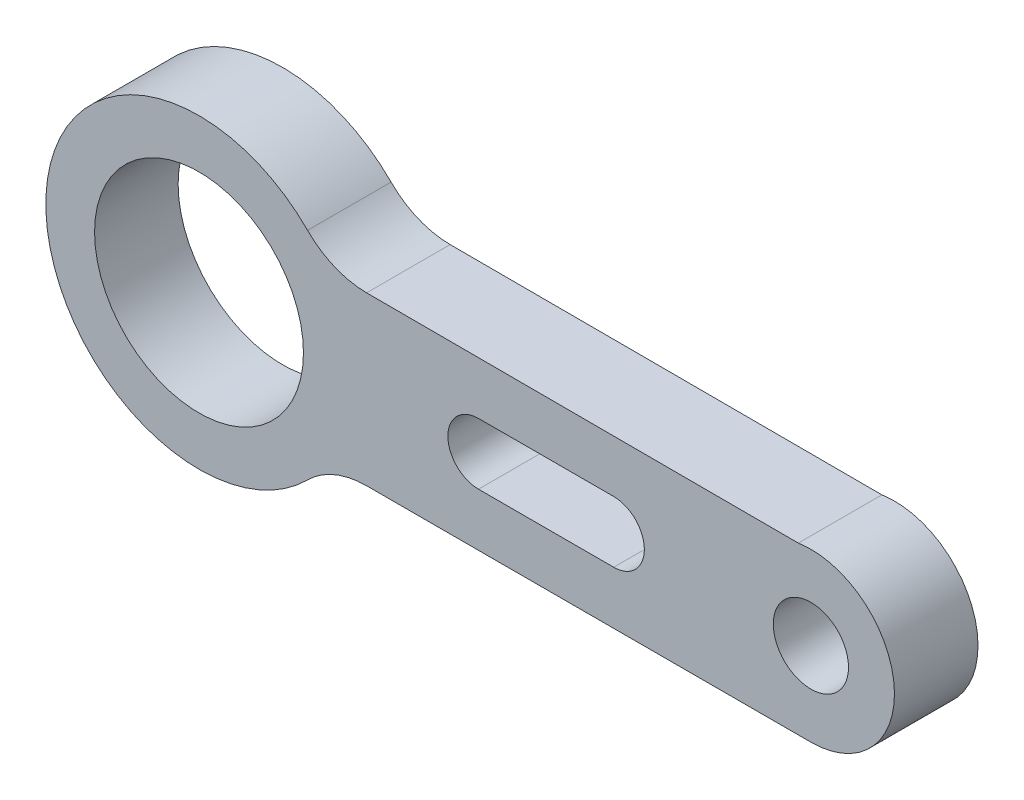
ISO-10303-21;
HEADER;
FILE_DESCRIPTION(('STEP AP214'),'2;1');
FILE_NAME('part.step','',(''),(''),'','','');
FILE_SCHEMA(('AUTOMOTIVE_DESIGN { 1 0 10303 214 1 1 1 1 }'));
ENDSEC;
DATA;
#1=APPLICATION_CONTEXT('core data for automotive mechanical design processes');
#2=APPLICATION_PROTOCOL_DEFINITION('international standard','automotive_design',2000,#1);
#3=PRODUCT_CONTEXT('',#1,'mechanical');
#4=PRODUCT('Part','Part','',(#3));
#5=PRODUCT_RELATED_PRODUCT_CATEGORY('part','',(#4));
#6=PRODUCT_DEFINITION_FORMATION('','',#4);
#7=PRODUCT_DEFINITION_CONTEXT('part definition',#1,'design');
#8=PRODUCT_DEFINITION('design','',#6,#7);
#9=PRODUCT_DEFINITION_SHAPE('','',#8);
#10=(LENGTH_UNIT() NAMED_UNIT(*) SI_UNIT(.MILLI.,.METRE.));
#11=(NAMED_UNIT(*) PLANE_ANGLE_UNIT() SI_UNIT($,.RADIAN.));
#12=(NAMED_UNIT(*) SI_UNIT($,.STERADIAN.) SOLID_ANGLE_UNIT());
#13=UNCERTAINTY_MEASURE_WITH_UNIT(LENGTH_MEASURE(1.E-05),#10,'distance_accuracy_value','');
#14=(GEOMETRIC_REPRESENTATION_CONTEXT(3) GLOBAL_UNCERTAINTY_ASSIGNED_CONTEXT((#13)) GLOBAL_UNIT_ASSIGNED_CONTEXT((#10,
#11,#12)) REPRESENTATION_CONTEXT('',''));
#15=CARTESIAN_POINT('',(0.,0.,0.));
#16=DIRECTION('',(0.,0.,1.));
#17=DIRECTION('',(1.,0.,0.));
#18=AXIS2_PLACEMENT_3D('',#15,#16,#17);
#19=CARTESIAN_POINT('',(-3.98797726940064,21.4662374553055,3.));
#20=DIRECTION('',(0.,0.,1.));
#21=DIRECTION('',(1.,0.,0.));
#22=AXIS2_PLACEMENT_3D('',#19,#20,#21);
#23=PLANE('',#22);
#24=CARTESIAN_POINT('',(-25.9582811689159,21.4662374553055,3.));
#25=DIRECTION('',(0.,0.,1.));
#26=DIRECTION('',(1.,0.,0.));
#27=AXIS2_PLACEMENT_3D('',#24,#25,#26);
#28=CIRCLE('',#27,3.75);
#29=CARTESIAN_POINT('',(-22.2082811689159,21.4662374553055,3.));
#30=VERTEX_POINT('',#29);
#31=EDGE_CURVE('E152',#30,#30,#28,.T.);
#32=ORIENTED_EDGE('',*,*,#31,.F.);
#33=EDGE_LOOP('',(#32));
#34=FACE_BOUND('',#33,.T.);
#35=CARTESIAN_POINT('',(-3.98797726940064,21.4662374553055,3.));
#36=DIRECTION('',(0.,0.,1.));
#37=DIRECTION('',(1.,0.,0.));
#38=AXIS2_PLACEMENT_3D('',#35,#36,#37);
#39=CIRCLE('',#38,3.);
#40=CARTESIAN_POINT('',(-3.98797726940064,18.4662374553055,3.));
#41=VERTEX_POINT('',#40);
#42=CARTESIAN_POINT('',(-4.43963692197603,24.432043173527,3.));
#43=VERTEX_POINT('',#42);
#44=EDGE_CURVE('E164',#41,#43,#39,.T.);
#45=ORIENTED_EDGE('',*,*,#44,.T.);
#46=DIRECTION('',(-0.999997970749834,0.00201457097501609,0.));
#47=VECTOR('',#46,1.);
#48=CARTESIAN_POINT('',(-4.43963692197603,24.432043173527,3.));
#49=LINE('',#48,#47);
#50=CARTESIAN_POINT('',(-19.940566739442,24.4632709601921,3.));
#51=VERTEX_POINT('',#50);
#52=EDGE_CURVE('E167',#43,#51,#49,.T.);
#53=ORIENTED_EDGE('',*,*,#52,.T.);
#54=CARTESIAN_POINT('',(-19.9345230265169,27.4632648724416,3.));
#55=DIRECTION('',(0.,0.,-1.));
#56=DIRECTION('',(-1.,0.,0.));
#57=AXIS2_PLACEMENT_3D('',#54,#55,#56);
#58=CIRCLE('',#57,3.);
#59=CARTESIAN_POINT('',(-22.0605553120695,25.3466669605112,3.));
#60=VERTEX_POINT('',#59);
#61=EDGE_CURVE('E170',#51,#60,#58,.T.);
#62=ORIENTED_EDGE('',*,*,#61,.T.);
#63=CARTESIAN_POINT('',(-25.9582811689159,21.4662374553055,3.));
#64=DIRECTION('',(0.,0.,1.));
#65=DIRECTION('',(1.,0.,0.));
#66=AXIS2_PLACEMENT_3D('',#63,#64,#65);
#67=CIRCLE('',#66,5.5);
#68=CARTESIAN_POINT('',(-22.0643681839501,17.5819818425125,3.));
#69=VERTEX_POINT('',#68);
#70=EDGE_CURVE('E172',#60,#69,#67,.T.);
#71=ORIENTED_EDGE('',*,*,#70,.T.);
#72=CARTESIAN_POINT('',(-19.940415646696,15.4632969628072,3.));
#73=DIRECTION('',(0.,0.,-1.));
#74=DIRECTION('',(1.,0.,0.));
#75=AXIS2_PLACEMENT_3D('',#72,#73,#74);
#76=CIRCLE('',#75,3.);
#77=CARTESIAN_POINT('',(-19.9409686232532,18.4632969118433,3.));
#78=VERTEX_POINT('',#77);
#79=EDGE_CURVE('E174',#69,#78,#76,.T.);
#80=ORIENTED_EDGE('',*,*,#79,.T.);
#81=DIRECTION('',(0.999999983012051,0.000184325519082915,0.));
#82=VECTOR('',#81,1.);
#83=CARTESIAN_POINT('',(-3.98797726940064,18.4662374553055,3.));
#84=LINE('',#83,#82);
#85=EDGE_CURVE('E176',#78,#41,#84,.T.);
#86=ORIENTED_EDGE('',*,*,#85,.T.);
#87=EDGE_LOOP('',(#45,#53,#62,#71,#80,#86));
#88=FACE_BOUND('',#87,.T.);
#89=CARTESIAN_POINT('',(-3.98797726940064,21.4662374553055,3.));
#90=DIRECTION('',(0.,0.,1.));
#91=DIRECTION('',(1.,0.,0.));
#92=AXIS2_PLACEMENT_3D('',#89,#90,#91);
#93=CIRCLE('',#92,1.35);
#94=CARTESIAN_POINT('',(-2.63797726940064,21.4662374553055,3.));
#95=VERTEX_POINT('',#94);
#96=EDGE_CURVE('E158',#95,#95,#93,.T.);
#97=ORIENTED_EDGE('',*,*,#96,.F.);
#98=EDGE_LOOP('',(#97));
#99=FACE_BOUND('',#98,.T.);
#100=DIRECTION('',(1.,0.,0.));
#101=VECTOR('',#100,1.);
#102=CARTESIAN_POINT('',(-15.9219501795346,20.3662374553055,3.));
#103=LINE('',#102,#101);
#104=CARTESIAN_POINT('',(-15.9219501795346,20.3662374553055,3.));
#105=VERTEX_POINT('',#104);
#106=CARTESIAN_POINT('',(-11.0683555835525,20.3662374553055,3.));
#107=VERTEX_POINT('',#106);
#108=EDGE_CURVE('E124',#105,#107,#103,.T.);
#109=ORIENTED_EDGE('',*,*,#108,.F.);
#110=CARTESIAN_POINT('',(-15.9219501795346,21.4662374553055,3.));
#111=DIRECTION('',(0.,0.,1.));
#112=DIRECTION('',(1.,0.,0.));
#113=AXIS2_PLACEMENT_3D('',#110,#111,#112);
#114=CIRCLE('',#113,1.1);
#115=CARTESIAN_POINT('',(-15.9219501795346,22.5662374553055,3.));
#116=VERTEX_POINT('',#115);
#117=EDGE_CURVE('E116',#116,#105,#114,.T.);
#118=ORIENTED_EDGE('',*,*,#117,.F.);
#119=DIRECTION('',(-1.,0.,0.));
#120=VECTOR('',#119,1.);
#121=CARTESIAN_POINT('',(-15.9219501795346,22.5662374553055,3.));
#122=LINE('',#121,#120);
#123=CARTESIAN_POINT('',(-11.0683555835525,22.5662374553055,3.));
#124=VERTEX_POINT('',#123);
#125=EDGE_CURVE('E138',#124,#116,#122,.T.);
#126=ORIENTED_EDGE('',*,*,#125,.F.);
#127=CARTESIAN_POINT('',(-11.0683555835525,21.4662374553055,3.));
#128=DIRECTION('',(0.,0.,1.));
#129=DIRECTION('',(1.,0.,0.));
#130=AXIS2_PLACEMENT_3D('',#127,#128,#129);
#131=CIRCLE('',#130,1.1);
#132=EDGE_CURVE('E136',#107,#124,#131,.T.);
#133=ORIENTED_EDGE('',*,*,#132,.F.);
#134=EDGE_LOOP('',(#109,#118,#126,#133));
#135=FACE_BOUND('',#134,.T.);
#136=ADVANCED_FACE('F39',(#34,#88,#99,#135),#23,.T.);
#137=CARTESIAN_POINT('',(-3.98797726940064,21.4662374553055,0.));
#138=DIRECTION('',(0.,0.,1.));
#139=DIRECTION('',(1.,0.,0.));
#140=AXIS2_PLACEMENT_3D('',#137,#138,#139);
#141=PLANE('',#140);
#142=CARTESIAN_POINT('',(-25.9582811689159,21.4662374553055,0.));
#143=DIRECTION('',(0.,0.,1.));
#144=DIRECTION('',(1.,0.,0.));
#145=AXIS2_PLACEMENT_3D('',#142,#143,#144);
#146=CIRCLE('',#145,3.75);
#147=CARTESIAN_POINT('',(-22.2082811689159,21.4662374553055,0.));
#148=VERTEX_POINT('',#147);
#149=EDGE_CURVE('E132',#148,#148,#146,.T.);
#150=ORIENTED_EDGE('',*,*,#149,.T.);
#151=EDGE_LOOP('',(#150));
#152=FACE_BOUND('',#151,.T.);
#153=CARTESIAN_POINT('',(-3.98797726940064,21.4662374553055,0.));
#154=DIRECTION('',(0.,0.,1.));
#155=DIRECTION('',(1.,0.,0.));
#156=AXIS2_PLACEMENT_3D('',#153,#154,#155);
#157=CIRCLE('',#156,3.);
#158=CARTESIAN_POINT('',(-3.98797726940064,18.4662374553055,0.));
#159=VERTEX_POINT('',#158);
#160=CARTESIAN_POINT('',(-4.43963692197603,24.432043173527,0.));
#161=VERTEX_POINT('',#160);
#162=EDGE_CURVE('E161',#159,#161,#157,.T.);
#163=ORIENTED_EDGE('',*,*,#162,.F.);
#164=DIRECTION('',(0.999999983012051,0.000184325519082915,0.));
#165=VECTOR('',#164,1.);
#166=CARTESIAN_POINT('',(-3.98797726940064,18.4662374553055,0.));
#167=LINE('',#166,#165);
#168=CARTESIAN_POINT('',(-19.9409686232532,18.4632969118433,0.));
#169=VERTEX_POINT('',#168);
#170=EDGE_CURVE('E168',#169,#159,#167,.T.);
#171=ORIENTED_EDGE('',*,*,#170,.F.);
#172=CARTESIAN_POINT('',(-19.940415646696,15.4632969628072,0.));
#173=DIRECTION('',(0.,0.,-1.));
#174=DIRECTION('',(1.,0.,0.));
#175=AXIS2_PLACEMENT_3D('',#172,#173,#174);
#176=CIRCLE('',#175,3.);
#177=CARTESIAN_POINT('',(-22.0643681839501,17.5819818425125,0.));
#178=VERTEX_POINT('',#177);
#179=EDGE_CURVE('E187',#178,#169,#176,.T.);
#180=ORIENTED_EDGE('',*,*,#179,.F.);
#181=CARTESIAN_POINT('',(-25.9582811689159,21.4662374553055,0.));
#182=DIRECTION('',(0.,0.,1.));
#183=DIRECTION('',(1.,0.,0.));
#184=AXIS2_PLACEMENT_3D('',#181,#182,#183);
#185=CIRCLE('',#184,5.5);
#186=CARTESIAN_POINT('',(-22.0605553120695,25.3466669605112,0.));
#187=VERTEX_POINT('',#186);
#188=EDGE_CURVE('E185',#187,#178,#185,.T.);
#189=ORIENTED_EDGE('',*,*,#188,.F.);
#190=CARTESIAN_POINT('',(-19.9345230265169,27.4632648724416,0.));
#191=DIRECTION('',(0.,0.,-1.));
#192=DIRECTION('',(-1.,0.,0.));
#193=AXIS2_PLACEMENT_3D('',#190,#191,#192);
#194=CIRCLE('',#193,3.);
#195=CARTESIAN_POINT('',(-19.940566739442,24.4632709601921,0.));
#196=VERTEX_POINT('',#195);
#197=EDGE_CURVE('E183',#196,#187,#194,.T.);
#198=ORIENTED_EDGE('',*,*,#197,.F.);
#199=DIRECTION('',(-0.999997970749834,0.00201457097501609,0.));
#200=VECTOR('',#199,1.);
#201=CARTESIAN_POINT('',(-4.43963692197603,24.432043173527,0.));
#202=LINE('',#201,#200);
#203=EDGE_CURVE('E181',#161,#196,#202,.T.);
#204=ORIENTED_EDGE('',*,*,#203,.F.);
#205=EDGE_LOOP('',(#163,#171,#180,#189,#198,#204));
#206=FACE_BOUND('',#205,.T.);
#207=CARTESIAN_POINT('',(-3.98797726940064,21.4662374553055,0.));
#208=DIRECTION('',(0.,0.,1.));
#209=DIRECTION('',(1.,0.,0.));
#210=AXIS2_PLACEMENT_3D('',#207,#208,#209);
#211=CIRCLE('',#210,1.35);
#212=CARTESIAN_POINT('',(-2.63797726940064,21.4662374553055,0.));
#213=VERTEX_POINT('',#212);
#214=EDGE_CURVE('E155',#213,#213,#211,.T.);
#215=ORIENTED_EDGE('',*,*,#214,.T.);
#216=EDGE_LOOP('',(#215));
#217=FACE_BOUND('',#216,.T.);
#218=CARTESIAN_POINT('',(-15.9219501795346,21.4662374553055,0.));
#219=DIRECTION('',(0.,0.,1.));
#220=DIRECTION('',(1.,0.,0.));
#221=AXIS2_PLACEMENT_3D('',#218,#219,#220);
#222=CIRCLE('',#221,1.1);
#223=CARTESIAN_POINT('',(-15.9219501795346,22.5662374553055,0.));
#224=VERTEX_POINT('',#223);
#225=CARTESIAN_POINT('',(-15.9219501795346,20.3662374553055,0.));
#226=VERTEX_POINT('',#225);
#227=EDGE_CURVE('E62',#224,#226,#222,.T.);
#228=ORIENTED_EDGE('',*,*,#227,.T.);
#229=DIRECTION('',(1.,0.,0.));
#230=VECTOR('',#229,1.);
#231=CARTESIAN_POINT('',(-15.9219501795346,20.3662374553055,0.));
#232=LINE('',#231,#230);
#233=CARTESIAN_POINT('',(-11.0683555835525,20.3662374553055,0.));
#234=VERTEX_POINT('',#233);
#235=EDGE_CURVE('E131',#226,#234,#232,.T.);
#236=ORIENTED_EDGE('',*,*,#235,.T.);
#237=CARTESIAN_POINT('',(-11.0683555835525,21.4662374553055,0.));
#238=DIRECTION('',(0.,0.,1.));
#239=DIRECTION('',(1.,0.,0.));
#240=AXIS2_PLACEMENT_3D('',#237,#238,#239);
#241=CIRCLE('',#240,1.1);
#242=CARTESIAN_POINT('',(-11.0683555835525,22.5662374553055,0.));
#243=VERTEX_POINT('',#242);
#244=EDGE_CURVE('E144',#234,#243,#241,.T.);
#245=ORIENTED_EDGE('',*,*,#244,.T.);
#246=DIRECTION('',(-1.,0.,0.));
#247=VECTOR('',#246,1.);
#248=CARTESIAN_POINT('',(-15.9219501795346,22.5662374553055,0.));
#249=LINE('',#248,#247);
#250=EDGE_CURVE('E125',#243,#224,#249,.T.);
#251=ORIENTED_EDGE('',*,*,#250,.T.);
#252=EDGE_LOOP('',(#228,#236,#245,#251));
#253=FACE_BOUND('',#252,.T.);
#254=ADVANCED_FACE('F211',(#152,#206,#217,#253),#141,.F.);
#255=CARTESIAN_POINT('',(-3.98797726940064,21.4662374553055,3.));
#256=DIRECTION('',(0.,0.,-1.));
#257=DIRECTION('',(-1.,0.,0.));
#258=AXIS2_PLACEMENT_3D('',#255,#256,#257);
#259=CYLINDRICAL_SURFACE('',#258,3.);
#260=ORIENTED_EDGE('',*,*,#162,.T.);
#261=DIRECTION('',(0.,0.,-1.));
#262=VECTOR('',#261,1.);
#263=CARTESIAN_POINT('',(-4.43963692197603,24.432043173527,3.));
#264=LINE('',#263,#262);
#265=EDGE_CURVE('E11',#43,#161,#264,.T.);
#266=ORIENTED_EDGE('',*,*,#265,.F.);
#267=ORIENTED_EDGE('',*,*,#44,.F.);
#268=DIRECTION('',(0.,0.,-1.));
#269=VECTOR('',#268,1.);
#270=CARTESIAN_POINT('',(-3.98797726940064,18.4662374553055,3.));
#271=LINE('',#270,#269);
#272=EDGE_CURVE('E178',#41,#159,#271,.T.);
#273=ORIENTED_EDGE('',*,*,#272,.T.);
#274=EDGE_LOOP('',(#260,#266,#267,#273));
#275=FACE_BOUND('',#274,.T.);
#276=ADVANCED_FACE('F41',(#275),#259,.T.);
#277=CARTESIAN_POINT('',(-4.43963692197603,24.432043173527,3.));
#278=DIRECTION('',(-0.00201457097501609,-0.999997970749834,0.));
#279=DIRECTION('',(0.999997970749835,-0.00201457097501609,0.));
#280=AXIS2_PLACEMENT_3D('',#277,#278,#279);
#281=PLANE('',#280);
#282=ORIENTED_EDGE('',*,*,#203,.T.);
#283=DIRECTION('',(0.,0.,-1.));
#284=VECTOR('',#283,1.);
#285=CARTESIAN_POINT('',(-19.940566739442,24.4632709601921,3.));
#286=LINE('',#285,#284);
#287=EDGE_CURVE('E47',#51,#196,#286,.T.);
#288=ORIENTED_EDGE('',*,*,#287,.F.);
#289=ORIENTED_EDGE('',*,*,#52,.F.);
#290=ORIENTED_EDGE('',*,*,#265,.T.);
#291=EDGE_LOOP('',(#282,#288,#289,#290));
#292=FACE_BOUND('',#291,.T.);
#293=ADVANCED_FACE('F229',(#292),#281,.F.);
#294=CARTESIAN_POINT('',(-19.9345230265169,27.4632648724416,3.));
#295=DIRECTION('',(0.,0.,-1.));
#296=DIRECTION('',(-1.,0.,0.));
#297=AXIS2_PLACEMENT_3D('',#294,#295,#296);
#298=CYLINDRICAL_SURFACE('',#297,3.);
#299=ORIENTED_EDGE('',*,*,#197,.T.);
#300=DIRECTION('',(0.,0.,-1.));
#301=VECTOR('',#300,1.);
#302=CARTESIAN_POINT('',(-22.0605553120695,25.3466669605112,3.));
#303=LINE('',#302,#301);
#304=EDGE_CURVE('E198',#60,#187,#303,.T.);
#305=ORIENTED_EDGE('',*,*,#304,.F.);
#306=ORIENTED_EDGE('',*,*,#61,.F.);
#307=ORIENTED_EDGE('',*,*,#287,.T.);
#308=EDGE_LOOP('',(#299,#305,#306,#307));
#309=FACE_BOUND('',#308,.T.);
#310=ADVANCED_FACE('F205',(#309),#298,.F.);
#311=CARTESIAN_POINT('',(-25.9582811689159,21.4662374553055,3.));
#312=DIRECTION('',(0.,0.,-1.));
#313=DIRECTION('',(-1.,0.,0.));
#314=AXIS2_PLACEMENT_3D('',#311,#312,#313);
#315=CYLINDRICAL_SURFACE('',#314,5.5);
#316=ORIENTED_EDGE('',*,*,#188,.T.);
#317=DIRECTION('',(0.,0.,-1.));
#318=VECTOR('',#317,1.);
#319=CARTESIAN_POINT('',(-22.0643681839501,17.5819818425125,3.));
#320=LINE('',#319,#318);
#321=EDGE_CURVE('E195',#69,#178,#320,.T.);
#322=ORIENTED_EDGE('',*,*,#321,.F.);
#323=ORIENTED_EDGE('',*,*,#70,.F.);
#324=ORIENTED_EDGE('',*,*,#304,.T.);
#325=EDGE_LOOP('',(#316,#322,#323,#324));
#326=FACE_BOUND('',#325,.T.);
#327=ADVANCED_FACE('F217',(#326),#315,.T.);
#328=CARTESIAN_POINT('',(-19.940415646696,15.4632969628072,3.));
#329=DIRECTION('',(0.,0.,-1.));
#330=DIRECTION('',(-1.,0.,0.));
#331=AXIS2_PLACEMENT_3D('',#328,#329,#330);
#332=CYLINDRICAL_SURFACE('',#331,3.);
#333=ORIENTED_EDGE('',*,*,#179,.T.);
#334=DIRECTION('',(0.,0.,-1.));
#335=VECTOR('',#334,1.);
#336=CARTESIAN_POINT('',(-19.9409686232532,18.4632969118433,3.));
#337=LINE('',#336,#335);
#338=EDGE_CURVE('E192',#78,#169,#337,.T.);
#339=ORIENTED_EDGE('',*,*,#338,.F.);
#340=ORIENTED_EDGE('',*,*,#79,.F.);
#341=ORIENTED_EDGE('',*,*,#321,.T.);
#342=EDGE_LOOP('',(#333,#339,#340,#341));
#343=FACE_BOUND('',#342,.T.);
#344=ADVANCED_FACE('F221',(#343),#332,.F.);
#345=CARTESIAN_POINT('',(-3.98797726940064,18.4662374553055,3.));
#346=DIRECTION('',(-0.000184325519082915,0.999999983012051,0.));
#347=DIRECTION('',(-0.999999983012052,-0.000184325519082915,0.));
#348=AXIS2_PLACEMENT_3D('',#345,#346,#347);
#349=PLANE('',#348);
#350=ORIENTED_EDGE('',*,*,#170,.T.);
#351=ORIENTED_EDGE('',*,*,#272,.F.);
#352=ORIENTED_EDGE('',*,*,#85,.F.);
#353=ORIENTED_EDGE('',*,*,#338,.T.);
#354=EDGE_LOOP('',(#350,#351,#352,#353));
#355=FACE_BOUND('',#354,.T.);
#356=ADVANCED_FACE('F232',(#355),#349,.F.);
#357=CARTESIAN_POINT('',(-3.98797726940064,21.4662374553055,3.));
#358=DIRECTION('',(0.,0.,-1.));
#359=DIRECTION('',(-1.,0.,0.));
#360=AXIS2_PLACEMENT_3D('',#357,#358,#359);
#361=CYLINDRICAL_SURFACE('',#360,1.35);
#362=ORIENTED_EDGE('',*,*,#96,.T.);
#363=EDGE_LOOP('',(#362));
#364=FACE_BOUND('',#363,.T.);
#365=ORIENTED_EDGE('',*,*,#214,.F.);
#366=EDGE_LOOP('',(#365));
#367=FACE_BOUND('',#366,.T.);
#368=ADVANCED_FACE('F234',(#364,#367),#361,.F.);
#369=CARTESIAN_POINT('',(-25.9582811689159,21.4662374553055,3.));
#370=DIRECTION('',(0.,0.,-1.));
#371=DIRECTION('',(-1.,0.,0.));
#372=AXIS2_PLACEMENT_3D('',#369,#370,#371);
#373=CYLINDRICAL_SURFACE('',#372,3.75);
#374=ORIENTED_EDGE('',*,*,#31,.T.);
#375=EDGE_LOOP('',(#374));
#376=FACE_BOUND('',#375,.T.);
#377=ORIENTED_EDGE('',*,*,#149,.F.);
#378=EDGE_LOOP('',(#377));
#379=FACE_BOUND('',#378,.T.);
#380=ADVANCED_FACE('F240',(#376,#379),#373,.F.);
#381=CARTESIAN_POINT('',(-15.9219501795346,21.4662374553055,3.));
#382=DIRECTION('',(0.,0.,-1.));
#383=DIRECTION('',(-1.,0.,0.));
#384=AXIS2_PLACEMENT_3D('',#381,#382,#383);
#385=CYLINDRICAL_SURFACE('',#384,1.1);
#386=ORIENTED_EDGE('',*,*,#227,.F.);
#387=DIRECTION('',(0.,0.,-1.));
#388=VECTOR('',#387,1.);
#389=CARTESIAN_POINT('',(-15.9219501795346,22.5662374553055,3.));
#390=LINE('',#389,#388);
#391=EDGE_CURVE('E120',#116,#224,#390,.T.);
#392=ORIENTED_EDGE('',*,*,#391,.F.);
#393=ORIENTED_EDGE('',*,*,#117,.T.);
#394=DIRECTION('',(0.,0.,-1.));
#395=VECTOR('',#394,1.);
#396=CARTESIAN_POINT('',(-15.9219501795346,20.3662374553055,3.));
#397=LINE('',#396,#395);
#398=EDGE_CURVE('E119',#105,#226,#397,.T.);
#399=ORIENTED_EDGE('',*,*,#398,.T.);
#400=EDGE_LOOP('',(#386,#392,#393,#399));
#401=FACE_BOUND('',#400,.T.);
#402=ADVANCED_FACE('F118',(#401),#385,.F.);
#403=CARTESIAN_POINT('',(-15.9219501795346,20.3662374553055,3.));
#404=DIRECTION('',(0.,1.,0.));
#405=DIRECTION('',(0.,0.,1.));
#406=AXIS2_PLACEMENT_3D('',#403,#404,#405);
#407=PLANE('',#406);
#408=ORIENTED_EDGE('',*,*,#235,.F.);
#409=ORIENTED_EDGE('',*,*,#398,.F.);
#410=ORIENTED_EDGE('',*,*,#108,.T.);
#411=DIRECTION('',(0.,0.,-1.));
#412=VECTOR('',#411,1.);
#413=CARTESIAN_POINT('',(-11.0683555835525,20.3662374553055,3.));
#414=LINE('',#413,#412);
#415=EDGE_CURVE('E133',#107,#234,#414,.T.);
#416=ORIENTED_EDGE('',*,*,#415,.T.);
#417=EDGE_LOOP('',(#408,#409,#410,#416));
#418=FACE_BOUND('',#417,.T.);
#419=ADVANCED_FACE('F128',(#418),#407,.T.);
#420=CARTESIAN_POINT('',(-11.0683555835525,21.4662374553055,3.));
#421=DIRECTION('',(0.,0.,-1.));
#422=DIRECTION('',(-1.,0.,0.));
#423=AXIS2_PLACEMENT_3D('',#420,#421,#422);
#424=CYLINDRICAL_SURFACE('',#423,1.1);
#425=ORIENTED_EDGE('',*,*,#244,.F.);
#426=ORIENTED_EDGE('',*,*,#415,.F.);
#427=ORIENTED_EDGE('',*,*,#132,.T.);
#428=DIRECTION('',(0.,0.,-1.));
#429=VECTOR('',#428,1.);
#430=CARTESIAN_POINT('',(-11.0683555835525,22.5662374553055,3.));
#431=LINE('',#430,#429);
#432=EDGE_CURVE('E54',#124,#243,#431,.T.);
#433=ORIENTED_EDGE('',*,*,#432,.T.);
#434=EDGE_LOOP('',(#425,#426,#427,#433));
#435=FACE_BOUND('',#434,.T.);
#436=ADVANCED_FACE('F261',(#435),#424,.F.);
#437=CARTESIAN_POINT('',(-15.9219501795346,22.5662374553055,3.));
#438=DIRECTION('',(0.,-1.,0.));
#439=DIRECTION('',(0.,0.,-1.));
#440=AXIS2_PLACEMENT_3D('',#437,#438,#439);
#441=PLANE('',#440);
#442=ORIENTED_EDGE('',*,*,#250,.F.);
#443=ORIENTED_EDGE('',*,*,#432,.F.);
#444=ORIENTED_EDGE('',*,*,#125,.T.);
#445=ORIENTED_EDGE('',*,*,#391,.T.);
#446=EDGE_LOOP('',(#442,#443,#444,#445));
#447=FACE_BOUND('',#446,.T.);
#448=ADVANCED_FACE('F264',(#447),#441,.T.);
#449=CLOSED_SHELL('',(#136,#254,#276,#293,#310,#327,#344,#356,#368,#380,#402,#419,#436,#448));
#450=MANIFOLD_SOLID_BREP('B2',#449);
#451=ADVANCED_BREP_SHAPE_REPRESENTATION('',(#18,#450),#14);
#452=SHAPE_DEFINITION_REPRESENTATION(#9,#451);
ENDSEC;
END-ISO-10303-21;
